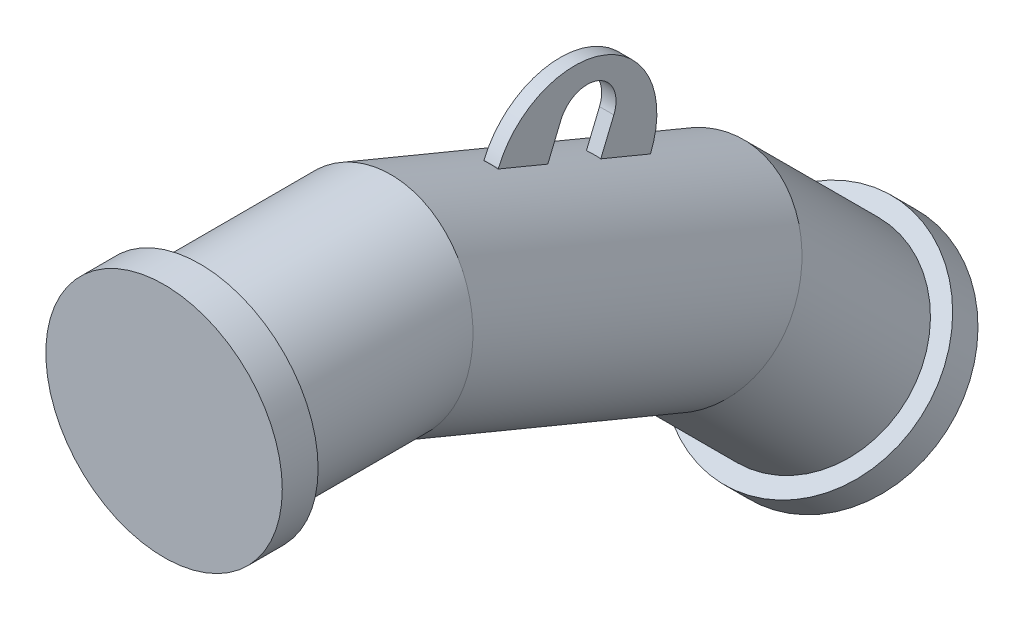
ISO-10303-21;
HEADER;
FILE_DESCRIPTION(('STEP AP214'),'2;1');
FILE_NAME('part.step','',(''),(''),'','','');
FILE_SCHEMA(('AUTOMOTIVE_DESIGN { 1 0 10303 214 1 1 1 1 }'));
ENDSEC;
DATA;
#1=APPLICATION_CONTEXT('core data for automotive mechanical design processes');
#2=APPLICATION_PROTOCOL_DEFINITION('international standard','automotive_design',2000,#1);
#3=PRODUCT_CONTEXT('',#1,'mechanical');
#4=PRODUCT('Part','Part','',(#3));
#5=PRODUCT_RELATED_PRODUCT_CATEGORY('part','',(#4));
#6=PRODUCT_DEFINITION_FORMATION('','',#4);
#7=PRODUCT_DEFINITION_CONTEXT('part definition',#1,'design');
#8=PRODUCT_DEFINITION('design','',#6,#7);
#9=PRODUCT_DEFINITION_SHAPE('','',#8);
#10=(LENGTH_UNIT() NAMED_UNIT(*) SI_UNIT(.MILLI.,.METRE.));
#11=(NAMED_UNIT(*) PLANE_ANGLE_UNIT() SI_UNIT($,.RADIAN.));
#12=(NAMED_UNIT(*) SI_UNIT($,.STERADIAN.) SOLID_ANGLE_UNIT());
#13=UNCERTAINTY_MEASURE_WITH_UNIT(LENGTH_MEASURE(1.E-05),#10,'distance_accuracy_value','');
#14=(GEOMETRIC_REPRESENTATION_CONTEXT(3) GLOBAL_UNCERTAINTY_ASSIGNED_CONTEXT((#13)) GLOBAL_UNIT_ASSIGNED_CONTEXT((#10,
#11,#12)) REPRESENTATION_CONTEXT('',''));
#15=CARTESIAN_POINT('',(0.,0.,0.));
#16=DIRECTION('',(0.,0.,1.));
#17=DIRECTION('',(1.,0.,0.));
#18=AXIS2_PLACEMENT_3D('',#15,#16,#17);
#19=CARTESIAN_POINT('',(0.,0.,0.));
#20=DIRECTION('',(0.,0.,0.999999999999916));
#21=DIRECTION('',(1.00000000000005,0.,0.));
#22=AXIS2_PLACEMENT_3D('',#19,#20,#21);
#23=PLANE('',#22);
#24=CARTESIAN_POINT('',(0.,0.,0.));
#25=DIRECTION('',(0.,0.,0.999999999999916));
#26=DIRECTION('',(1.00000000000005,0.,0.));
#27=AXIS2_PLACEMENT_3D('',#24,#25,#26);
#28=CIRCLE('',#27,82.5);
#29=CARTESIAN_POINT('',(82.5000000000045,-8.35834031172185E-13,-2.87214887425358E-13));
#30=VERTEX_POINT('',#29);
#31=EDGE_CURVE('E19',#30,#30,#28,.T.);
#32=ORIENTED_EDGE('',*,*,#31,.T.);
#33=EDGE_LOOP('',(#32));
#34=FACE_BOUND('',#33,.T.);
#35=ADVANCED_FACE('F15',(#34),#23,.T.);
#36=CARTESIAN_POINT('',(-4.26337247165444E-11,1.61815005839117E-11,-24.9999999999988));
#37=DIRECTION('',(0.,0.,0.999999999999916));
#38=DIRECTION('',(1.00000000000005,0.,0.));
#39=AXIS2_PLACEMENT_3D('',#36,#37,#38);
#40=CYLINDRICAL_SURFACE('',#39,82.5);
#41=CARTESIAN_POINT('',(-4.26337247165444E-11,1.61815005839117E-11,-24.9999999999988));
#42=DIRECTION('',(0.,0.,0.999999999999916));
#43=DIRECTION('',(1.00000000000005,0.,0.));
#44=AXIS2_PLACEMENT_3D('',#41,#42,#43);
#45=CIRCLE('',#44,82.5);
#46=CARTESIAN_POINT('',(82.4999999999618,1.53456665527395E-11,-24.9999999999991));
#47=VERTEX_POINT('',#46);
#48=EDGE_CURVE('E25',#47,#47,#45,.T.);
#49=ORIENTED_EDGE('',*,*,#48,.T.);
#50=EDGE_LOOP('',(#49));
#51=FACE_BOUND('',#50,.T.);
#52=ORIENTED_EDGE('',*,*,#31,.F.);
#53=EDGE_LOOP('',(#52));
#54=FACE_BOUND('',#53,.T.);
#55=ADVANCED_FACE('F17',(#51,#54),#40,.T.);
#56=CARTESIAN_POINT('',(-4.26337247165444E-11,1.61815005839117E-11,-24.9999999999988));
#57=DIRECTION('',(0.,0.,0.999999999999916));
#58=DIRECTION('',(1.00000000000005,0.,0.));
#59=AXIS2_PLACEMENT_3D('',#56,#57,#58);
#60=PLANE('',#59);
#61=CARTESIAN_POINT('',(2.82496841256107E-13,-3.70052382076315E-13,-24.9999999999986));
#62=DIRECTION('',(0.,0.,-0.999999999999921));
#63=DIRECTION('',(0.,0.999999999999963,0.));
#64=AXIS2_PLACEMENT_3D('',#61,#62,#63);
#65=CIRCLE('',#64,69.85);
#66=CARTESIAN_POINT('',(8.92674501720334E-13,69.849999999997,-24.9999999999982));
#67=VERTEX_POINT('',#66);
#68=EDGE_CURVE('E10',#67,#67,#65,.T.);
#69=ORIENTED_EDGE('',*,*,#68,.F.);
#70=EDGE_LOOP('',(#69));
#71=FACE_BOUND('',#70,.T.);
#72=ORIENTED_EDGE('',*,*,#48,.F.);
#73=EDGE_LOOP('',(#72));
#74=FACE_BOUND('',#73,.T.);
#75=ADVANCED_FACE('F197',(#71,#74),#60,.F.);
#76=CARTESIAN_POINT('',(-6.21841930394499E-12,-193.413600818346,-466.941738241031));
#77=DIRECTION('',(0.,-0.707106781186496,-0.707106781186481));
#78=DIRECTION('',(-1.00000000000005,0.,0.));
#79=AXIS2_PLACEMENT_3D('',#76,#77,#78);
#80=PLANE('',#79);
#81=CARTESIAN_POINT('',(-6.21841930394499E-12,-193.413600818346,-466.941738241031));
#82=DIRECTION('',(0.,-0.707106781186496,-0.707106781186481));
#83=DIRECTION('',(-1.00000000000005,0.,0.));
#84=AXIS2_PLACEMENT_3D('',#81,#82,#83);
#85=CIRCLE('',#84,82.5);
#86=CARTESIAN_POINT('',(-82.5000000000107,-193.413600818346,-466.94173824103));
#87=VERTEX_POINT('',#86);
#88=EDGE_CURVE('E179',#87,#87,#85,.T.);
#89=ORIENTED_EDGE('',*,*,#88,.T.);
#90=EDGE_LOOP('',(#89));
#91=FACE_BOUND('',#90,.T.);
#92=ADVANCED_FACE('F204',(#91),#80,.T.);
#93=CARTESIAN_POINT('',(3.64139176338186E-11,-175.735931288672,-449.26406871138));
#94=DIRECTION('',(0.,-0.707106781186496,-0.707106781186481));
#95=DIRECTION('',(-1.00000000000005,0.,0.));
#96=AXIS2_PLACEMENT_3D('',#93,#94,#95);
#97=CYLINDRICAL_SURFACE('',#96,82.5);
#98=CARTESIAN_POINT('',(3.64139176338186E-11,-175.735931288672,-449.26406871138));
#99=DIRECTION('',(0.,-0.707106781186496,-0.707106781186481));
#100=DIRECTION('',(-1.00000000000005,0.,0.));
#101=AXIS2_PLACEMENT_3D('',#98,#99,#100);
#102=CIRCLE('',#101,82.5);
#103=CARTESIAN_POINT('',(-82.4999999999681,-175.735931288672,-449.264068711379));
#104=VERTEX_POINT('',#103);
#105=EDGE_CURVE('E153',#104,#104,#102,.T.);
#106=ORIENTED_EDGE('',*,*,#105,.T.);
#107=EDGE_LOOP('',(#106));
#108=FACE_BOUND('',#107,.T.);
#109=ORIENTED_EDGE('',*,*,#88,.F.);
#110=EDGE_LOOP('',(#109));
#111=FACE_BOUND('',#110,.T.);
#112=ADVANCED_FACE('F214',(#108,#111),#97,.T.);
#113=CARTESIAN_POINT('',(3.64139176338186E-11,-175.735931288672,-449.26406871138));
#114=DIRECTION('',(0.,-0.707106781186496,-0.707106781186481));
#115=DIRECTION('',(-1.00000000000005,0.,0.));
#116=AXIS2_PLACEMENT_3D('',#113,#114,#115);
#117=PLANE('',#116);
#118=CARTESIAN_POINT('',(-1.21882993579131E-12,-175.735931288683,-449.264068711368));
#119=DIRECTION('',(0.,0.707106781186488,0.707106781186495));
#120=DIRECTION('',(0.,0.707106781186517,-0.707106781186525));
#121=AXIS2_PLACEMENT_3D('',#118,#119,#120);
#122=CIRCLE('',#121,69.85);
#123=CARTESIAN_POINT('',(-1.8105896901664E-12,-126.344522622805,-498.655477377247));
#124=VERTEX_POINT('',#123);
#125=EDGE_CURVE('E149',#124,#124,#122,.T.);
#126=ORIENTED_EDGE('',*,*,#125,.F.);
#127=EDGE_LOOP('',(#126));
#128=FACE_BOUND('',#127,.T.);
#129=ORIENTED_EDGE('',*,*,#105,.F.);
#130=EDGE_LOOP('',(#129));
#131=FACE_BOUND('',#130,.T.);
#132=ADVANCED_FACE('F217',(#128,#131),#117,.F.);
#133=CARTESIAN_POINT('',(6.94759500474921E-12,-91.3445609864393,-364.872698410294));
#134=DIRECTION('',(0.,0.382683432365097,0.923879532511179));
#135=DIRECTION('',(0.,-0.923879532511241,0.382683432365016));
#136=AXIS2_PLACEMENT_3D('',#133,#134,#135);
#137=CYLINDRICAL_SURFACE('',#136,69.85);
#138=CARTESIAN_POINT('',(4.16212892876642E-12,-38.0186118458926,-236.132468768786));
#139=DIRECTION('',(0.,0.382683432365091,0.923879532511287));
#140=DIRECTION('',(0.,-0.923879532511287,0.382683432365091));
#141=AXIS2_PLACEMENT_3D('',#138,#139,#140);
#142=CIRCLE('',#141,69.85);
#143=CARTESIAN_POINT('',(4.99999999999889,26.3488283928618,-262.794335490932));
#144=VERTEX_POINT('',#143);
#145=CARTESIAN_POINT('',(-5.00000000000111,26.348828392861,-262.794335490932));
#146=VERTEX_POINT('',#145);
#147=EDGE_CURVE('E172',#144,#146,#142,.T.);
#148=ORIENTED_EDGE('',*,*,#147,.F.);
#149=DIRECTION('',(0.,0.382683432365097,0.923879532511179));
#150=VECTOR('',#149,1.);
#151=CARTESIAN_POINT('',(5.00000000000028,-26.9771207476809,-391.534565132431));
#152=LINE('',#151,#150);
#153=CARTESIAN_POINT('',(5.00000000000028,40.6994571065655,-228.14885302175));
#154=VERTEX_POINT('',#153);
#155=EDGE_CURVE('E168',#144,#154,#152,.T.);
#156=ORIENTED_EDGE('',*,*,#155,.T.);
#157=CARTESIAN_POINT('',(3.41252784157975E-12,-23.6679831322002,-201.486986299613));
#158=DIRECTION('',(0.,-0.38268343236509,-0.923879532511287));
#159=DIRECTION('',(0.,0.923879532511287,-0.38268343236509));
#160=AXIS2_PLACEMENT_3D('',#157,#158,#159);
#161=CIRCLE('',#160,69.85);
#162=CARTESIAN_POINT('',(-4.99999999999972,40.699457106565,-228.14885302175));
#163=VERTEX_POINT('',#162);
#164=EDGE_CURVE('E161',#163,#154,#161,.T.);
#165=ORIENTED_EDGE('',*,*,#164,.F.);
#166=DIRECTION('',(0.,0.382683432365097,0.923879532511179));
#167=VECTOR('',#166,1.);
#168=CARTESIAN_POINT('',(-4.99999999999972,-26.9771207476818,-391.534565132431));
#169=LINE('',#168,#167);
#170=EDGE_CURVE('E165',#146,#163,#169,.T.);
#171=ORIENTED_EDGE('',*,*,#170,.F.);
#172=EDGE_LOOP('',(#148,#156,#165,#171));
#173=FACE_BOUND('',#172,.T.);
#174=CARTESIAN_POINT('',(6.94759500474921E-12,-91.3445609864393,-364.872698410294));
#175=DIRECTION('',(0.,-0.555570233019579,-0.831469612302443));
#176=DIRECTION('',(0.,-0.831469612302498,0.5555702330195));
#177=AXIS2_PLACEMENT_3D('',#174,#175,#176);
#178=ELLIPSE('',#177,71.218442400851,69.85);
#179=CARTESIAN_POINT('',(6.16989241807986E-12,-150.560531678263,-325.305851770368));
#180=VERTEX_POINT('',#179);
#181=EDGE_CURVE('E148',#180,#180,#178,.T.);
#182=ORIENTED_EDGE('',*,*,#181,.F.);
#183=EDGE_LOOP('',(#182));
#184=FACE_BOUND('',#183,.T.);
#185=CARTESIAN_POINT('',(-8.45514581214761E-11,6.04979249429979E-11,-144.347420427707));
#186=DIRECTION('',(0.,-0.195090322016126,-0.980785280403153));
#187=DIRECTION('',(0.,-0.98078528040319,0.195090322016101));
#188=AXIS2_PLACEMENT_3D('',#185,#186,#187);
#189=ELLIPSE('',#188,71.218442400851,69.85);
#190=CARTESIAN_POINT('',(-8.53661484978693E-11,-69.8499999999366,-130.45339156624));
#191=VERTEX_POINT('',#190);
#192=EDGE_CURVE('E156',#191,#191,#189,.T.);
#193=ORIENTED_EDGE('',*,*,#192,.T.);
#194=EDGE_LOOP('',(#193));
#195=FACE_BOUND('',#194,.T.);
#196=CARTESIAN_POINT('',(4.96170342176555E-12,-53.3259491404982,-273.087650069237));
#197=DIRECTION('',(0.,-0.38268343236509,-0.923879532511287));
#198=DIRECTION('',(0.,0.923879532511287,-0.38268343236509));
#199=AXIS2_PLACEMENT_3D('',#196,#197,#198);
#200=CIRCLE('',#199,69.85);
#201=CARTESIAN_POINT('',(-5.00000000000071,11.0414910982569,-299.749516791379));
#202=VERTEX_POINT('',#201);
#203=CARTESIAN_POINT('',(4.99999999999929,11.0414910982578,-299.74951679138));
#204=VERTEX_POINT('',#203);
#205=EDGE_CURVE('E46',#202,#204,#200,.T.);
#206=ORIENTED_EDGE('',*,*,#205,.F.);
#207=CARTESIAN_POINT('',(-4.99999999999972,-3.30913761542546,-334.394999260545));
#208=VERTEX_POINT('',#207);
#209=EDGE_CURVE('E169',#208,#202,#169,.T.);
#210=ORIENTED_EDGE('',*,*,#209,.F.);
#211=CARTESIAN_POINT('',(5.71130450895221E-12,-67.6765778541905,-307.733132538409));
#212=DIRECTION('',(0.,0.38268343236509,0.923879532511287));
#213=DIRECTION('',(0.,-0.923879532511287,0.38268343236509));
#214=AXIS2_PLACEMENT_3D('',#211,#212,#213);
#215=CIRCLE('',#214,69.85);
#216=CARTESIAN_POINT('',(5.00000000000029,-3.30913761542477,-334.394999260546));
#217=VERTEX_POINT('',#216);
#218=EDGE_CURVE('E108',#217,#208,#215,.T.);
#219=ORIENTED_EDGE('',*,*,#218,.F.);
#220=EDGE_CURVE('E38',#217,#204,#152,.T.);
#221=ORIENTED_EDGE('',*,*,#220,.T.);
#222=EDGE_LOOP('',(#206,#210,#219,#221));
#223=FACE_BOUND('',#222,.T.);
#224=ADVANCED_FACE('F223',(#173,#184,#195,#223),#137,.T.);
#225=CARTESIAN_POINT('',(-8.45514581214761E-11,6.04979249429979E-11,-144.347420427707));
#226=DIRECTION('',(0.,0.,0.999999999999921));
#227=DIRECTION('',(0.,-0.999999999999963,0.));
#228=AXIS2_PLACEMENT_3D('',#225,#226,#227);
#229=CYLINDRICAL_SURFACE('',#228,69.85);
#230=ORIENTED_EDGE('',*,*,#68,.T.);
#231=EDGE_LOOP('',(#230));
#232=FACE_BOUND('',#231,.T.);
#233=ORIENTED_EDGE('',*,*,#192,.F.);
#234=EDGE_LOOP('',(#233));
#235=FACE_BOUND('',#234,.T.);
#236=ADVANCED_FACE('F225',(#232,#235),#229,.T.);
#237=CARTESIAN_POINT('',(8.36068436360604E-11,-91.3445609870859,-364.872698409857));
#238=DIRECTION('',(0.,-0.707106781186488,-0.707106781186495));
#239=DIRECTION('',(0.,-0.707106781186517,0.707106781186525));
#240=AXIS2_PLACEMENT_3D('',#237,#238,#239);
#241=CYLINDRICAL_SURFACE('',#240,69.85);
#242=ORIENTED_EDGE('',*,*,#125,.T.);
#243=EDGE_LOOP('',(#242));
#244=FACE_BOUND('',#243,.T.);
#245=ORIENTED_EDGE('',*,*,#181,.T.);
#246=EDGE_LOOP('',(#245));
#247=FACE_BOUND('',#246,.T.);
#248=ADVANCED_FACE('F228',(#244,#247),#241,.T.);
#249=CARTESIAN_POINT('',(5.00000000000028,40.7104557966009,-290.390960345143));
#250=DIRECTION('',(1.,0.,0.));
#251=DIRECTION('',(0.,0.923879532511287,-0.382683432365091));
#252=AXIS2_PLACEMENT_3D('',#249,#250,#251);
#253=PLANE('',#252);
#254=ORIENTED_EDGE('',*,*,#220,.F.);
#255=DIRECTION('',(0.,0.923879532511287,-0.38268343236509));
#256=VECTOR('',#255,1.);
#257=CARTESIAN_POINT('',(5.00000000000028,-12.24380590352,-330.694138480312));
#258=LINE('',#257,#256);
#259=CARTESIAN_POINT('',(5.00000000000028,-3.00501057840708,-334.520972803963));
#260=VERTEX_POINT('',#259);
#261=EDGE_CURVE('E112',#217,#260,#258,.T.);
#262=ORIENTED_EDGE('',*,*,#261,.T.);
#263=CARTESIAN_POINT('',(5.00000000000028,18.9992867825856,-281.397899684564));
#264=DIRECTION('',(1.,0.,0.));
#265=DIRECTION('',(0.,0.923879532511287,-0.382683432365091));
#266=AXIS2_PLACEMENT_3D('',#263,#264,#265);
#267=CIRCLE('',#266,57.5);
#268=CARTESIAN_POINT('',(5.00000000000028,41.0035841435782,-228.274826565165));
#269=VERTEX_POINT('',#268);
#270=EDGE_CURVE('E130',#260,#269,#267,.T.);
#271=ORIENTED_EDGE('',*,*,#270,.T.);
#272=DIRECTION('',(0.,0.923879532511287,-0.38268343236509));
#273=VECTOR('',#272,1.);
#274=CARTESIAN_POINT('',(5.00000000000028,31.7647888184654,-224.447992241514));
#275=LINE('',#274,#273);
#276=EDGE_CURVE('E263',#154,#269,#275,.T.);
#277=ORIENTED_EDGE('',*,*,#276,.F.);
#278=ORIENTED_EDGE('',*,*,#155,.F.);
#279=DIRECTION('',(0.,0.923879532511287,-0.382683432365091));
#280=VECTOR('',#279,1.);
#281=CARTESIAN_POINT('',(5.00000000000028,26.6529554298874,-262.920309034338));
#282=LINE('',#281,#280);
#283=CARTESIAN_POINT('',(5.00000000000028,48.3641244439028,-271.913369694918));
#284=VERTEX_POINT('',#283);
#285=EDGE_CURVE('E124',#144,#284,#282,.T.);
#286=ORIENTED_EDGE('',*,*,#285,.T.);
#287=CARTESIAN_POINT('',(5.00000000000028,40.7104557966009,-290.390960345143));
#288=DIRECTION('',(-1.,0.,0.));
#289=DIRECTION('',(0.,0.923879532511287,-0.382683432365091));
#290=AXIS2_PLACEMENT_3D('',#287,#288,#289);
#291=CIRCLE('',#290,20.);
#292=CARTESIAN_POINT('',(5.00000000000028,33.0567871492991,-308.868550995369));
#293=VERTEX_POINT('',#292);
#294=EDGE_CURVE('E273',#284,#293,#291,.T.);
#295=ORIENTED_EDGE('',*,*,#294,.T.);
#296=DIRECTION('',(0.,-0.923879532511287,0.38268343236509));
#297=VECTOR('',#296,1.);
#298=CARTESIAN_POINT('',(5.00000000000028,11.3456181352838,-299.87549033479));
#299=LINE('',#298,#297);
#300=EDGE_CURVE('E276',#293,#204,#299,.T.);
#301=ORIENTED_EDGE('',*,*,#300,.T.);
#302=EDGE_LOOP('',(#254,#262,#271,#277,#278,#286,#295,#301));
#303=FACE_BOUND('',#302,.T.);
#304=ADVANCED_FACE('F235',(#303),#253,.T.);
#305=CARTESIAN_POINT('',(-4.99999999999972,40.7104557966009,-290.390960345143));
#306=DIRECTION('',(1.,0.,0.));
#307=DIRECTION('',(0.,0.923879532511287,-0.382683432365091));
#308=AXIS2_PLACEMENT_3D('',#305,#306,#307);
#309=PLANE('',#308);
#310=DIRECTION('',(0.,0.923879532511287,-0.38268343236509));
#311=VECTOR('',#310,1.);
#312=CARTESIAN_POINT('',(-4.99999999999972,-12.24380590352,-330.694138480312));
#313=LINE('',#312,#311);
#314=CARTESIAN_POINT('',(-4.99999999999972,-3.00501057840716,-334.520972803963));
#315=VERTEX_POINT('',#314);
#316=EDGE_CURVE('E102',#208,#315,#313,.T.);
#317=ORIENTED_EDGE('',*,*,#316,.F.);
#318=ORIENTED_EDGE('',*,*,#209,.T.);
#319=DIRECTION('',(0.,-0.923879532511287,0.38268343236509));
#320=VECTOR('',#319,1.);
#321=CARTESIAN_POINT('',(-4.99999999999972,11.3456181352838,-299.87549033479));
#322=LINE('',#321,#320);
#323=CARTESIAN_POINT('',(-4.99999999999972,33.0567871492991,-308.868550995369));
#324=VERTEX_POINT('',#323);
#325=EDGE_CURVE('E125',#324,#202,#322,.T.);
#326=ORIENTED_EDGE('',*,*,#325,.F.);
#327=CARTESIAN_POINT('',(-4.99999999999972,40.7104557966009,-290.390960345143));
#328=DIRECTION('',(-1.,0.,0.));
#329=DIRECTION('',(0.,0.923879532511287,-0.382683432365091));
#330=AXIS2_PLACEMENT_3D('',#327,#328,#329);
#331=CIRCLE('',#330,20.);
#332=CARTESIAN_POINT('',(-4.99999999999972,48.3641244439028,-271.913369694918));
#333=VERTEX_POINT('',#332);
#334=EDGE_CURVE('E284',#333,#324,#331,.T.);
#335=ORIENTED_EDGE('',*,*,#334,.F.);
#336=DIRECTION('',(0.,0.923879532511287,-0.382683432365091));
#337=VECTOR('',#336,1.);
#338=CARTESIAN_POINT('',(-4.99999999999972,26.6529554298874,-262.920309034338));
#339=LINE('',#338,#337);
#340=EDGE_CURVE('E111',#146,#333,#339,.T.);
#341=ORIENTED_EDGE('',*,*,#340,.F.);
#342=ORIENTED_EDGE('',*,*,#170,.T.);
#343=DIRECTION('',(0.,0.923879532511287,-0.38268343236509));
#344=VECTOR('',#343,1.);
#345=CARTESIAN_POINT('',(-4.99999999999972,31.7647888184654,-224.447992241514));
#346=LINE('',#345,#344);
#347=CARTESIAN_POINT('',(-4.99999999999972,41.0035841435782,-228.274826565165));
#348=VERTEX_POINT('',#347);
#349=EDGE_CURVE('E119',#163,#348,#346,.T.);
#350=ORIENTED_EDGE('',*,*,#349,.T.);
#351=CARTESIAN_POINT('',(-4.99999999999972,18.9992867825857,-281.397899684564));
#352=DIRECTION('',(1.,0.,0.));
#353=DIRECTION('',(0.,0.923879532511287,-0.382683432365091));
#354=AXIS2_PLACEMENT_3D('',#351,#352,#353);
#355=CIRCLE('',#354,57.5);
#356=EDGE_CURVE('E115',#315,#348,#355,.T.);
#357=ORIENTED_EDGE('',*,*,#356,.F.);
#358=EDGE_LOOP('',(#317,#318,#326,#335,#341,#342,#350,#357));
#359=FACE_BOUND('',#358,.T.);
#360=ADVANCED_FACE('F116',(#359),#309,.F.);
#361=CARTESIAN_POINT('',(5.00000000000028,26.6529554298874,-262.920309034338));
#362=DIRECTION('',(0.,0.382683432365091,0.923879532511287));
#363=DIRECTION('',(0.,-0.923879532511287,0.382683432365091));
#364=AXIS2_PLACEMENT_3D('',#361,#362,#363);
#365=PLANE('',#364);
#366=ORIENTED_EDGE('',*,*,#285,.F.);
#367=ORIENTED_EDGE('',*,*,#147,.T.);
#368=ORIENTED_EDGE('',*,*,#340,.T.);
#369=DIRECTION('',(-1.,0.,0.));
#370=VECTOR('',#369,1.);
#371=CARTESIAN_POINT('',(5.00000000000028,48.3641244439028,-271.913369694918));
#372=LINE('',#371,#370);
#373=EDGE_CURVE('E140',#284,#333,#372,.T.);
#374=ORIENTED_EDGE('',*,*,#373,.F.);
#375=EDGE_LOOP('',(#366,#367,#368,#374));
#376=FACE_BOUND('',#375,.T.);
#377=ADVANCED_FACE('F237',(#376),#365,.F.);
#378=CARTESIAN_POINT('',(5.00000000000028,40.7104557966009,-290.390960345143));
#379=DIRECTION('',(-1.,0.,0.));
#380=DIRECTION('',(0.,-0.923879532511287,0.382683432365091));
#381=AXIS2_PLACEMENT_3D('',#378,#379,#380);
#382=CYLINDRICAL_SURFACE('',#381,20.);
#383=ORIENTED_EDGE('',*,*,#334,.T.);
#384=DIRECTION('',(-1.,0.,0.));
#385=VECTOR('',#384,1.);
#386=CARTESIAN_POINT('',(5.00000000000028,33.0567871492991,-308.868550995369));
#387=LINE('',#386,#385);
#388=EDGE_CURVE('E132',#293,#324,#387,.T.);
#389=ORIENTED_EDGE('',*,*,#388,.F.);
#390=ORIENTED_EDGE('',*,*,#294,.F.);
#391=ORIENTED_EDGE('',*,*,#373,.T.);
#392=EDGE_LOOP('',(#383,#389,#390,#391));
#393=FACE_BOUND('',#392,.T.);
#394=ADVANCED_FACE('F239',(#393),#382,.F.);
#395=CARTESIAN_POINT('',(5.00000000000028,11.3456181352838,-299.87549033479));
#396=DIRECTION('',(0.,-0.38268343236509,-0.923879532511287));
#397=DIRECTION('',(0.,0.923879532511287,-0.38268343236509));
#398=AXIS2_PLACEMENT_3D('',#395,#396,#397);
#399=PLANE('',#398);
#400=ORIENTED_EDGE('',*,*,#325,.T.);
#401=ORIENTED_EDGE('',*,*,#205,.T.);
#402=ORIENTED_EDGE('',*,*,#300,.F.);
#403=ORIENTED_EDGE('',*,*,#388,.T.);
#404=EDGE_LOOP('',(#400,#401,#402,#403));
#405=FACE_BOUND('',#404,.T.);
#406=ADVANCED_FACE('F243',(#405),#399,.F.);
#407=CARTESIAN_POINT('',(5.00000000000028,18.9992867825856,-281.397899684564));
#408=DIRECTION('',(-1.,0.,0.));
#409=DIRECTION('',(0.,-0.923879532511287,0.382683432365091));
#410=AXIS2_PLACEMENT_3D('',#407,#408,#409);
#411=CYLINDRICAL_SURFACE('',#410,57.5);
#412=ORIENTED_EDGE('',*,*,#356,.T.);
#413=DIRECTION('',(-1.,0.,0.));
#414=VECTOR('',#413,1.);
#415=CARTESIAN_POINT('',(5.00000000000028,41.0035841435782,-228.274826565165));
#416=LINE('',#415,#414);
#417=EDGE_CURVE('E133',#269,#348,#416,.T.);
#418=ORIENTED_EDGE('',*,*,#417,.F.);
#419=ORIENTED_EDGE('',*,*,#270,.F.);
#420=DIRECTION('',(-1.,0.,0.));
#421=VECTOR('',#420,1.);
#422=CARTESIAN_POINT('',(5.00000000000028,-3.00501057840708,-334.520972803963));
#423=LINE('',#422,#421);
#424=EDGE_CURVE('E107',#260,#315,#423,.T.);
#425=ORIENTED_EDGE('',*,*,#424,.T.);
#426=EDGE_LOOP('',(#412,#418,#419,#425));
#427=FACE_BOUND('',#426,.T.);
#428=ADVANCED_FACE('F128',(#427),#411,.T.);
#429=CARTESIAN_POINT('',(-4.99999999999972,-12.24380590352,-330.694138480312));
#430=DIRECTION('',(0.,0.38268343236509,0.923879532511287));
#431=DIRECTION('',(0.,-0.923879532511287,0.38268343236509));
#432=AXIS2_PLACEMENT_3D('',#429,#430,#431);
#433=PLANE('',#432);
#434=ORIENTED_EDGE('',*,*,#261,.F.);
#435=ORIENTED_EDGE('',*,*,#218,.T.);
#436=ORIENTED_EDGE('',*,*,#316,.T.);
#437=ORIENTED_EDGE('',*,*,#424,.F.);
#438=EDGE_LOOP('',(#434,#435,#436,#437));
#439=FACE_BOUND('',#438,.T.);
#440=ADVANCED_FACE('F105',(#439),#433,.F.);
#441=CARTESIAN_POINT('',(5.00000000000028,31.7647888184654,-224.447992241514));
#442=DIRECTION('',(0.,-0.38268343236509,-0.923879532511287));
#443=DIRECTION('',(0.,0.923879532511287,-0.38268343236509));
#444=AXIS2_PLACEMENT_3D('',#441,#442,#443);
#445=PLANE('',#444);
#446=ORIENTED_EDGE('',*,*,#349,.F.);
#447=ORIENTED_EDGE('',*,*,#164,.T.);
#448=ORIENTED_EDGE('',*,*,#276,.T.);
#449=ORIENTED_EDGE('',*,*,#417,.T.);
#450=EDGE_LOOP('',(#446,#447,#448,#449));
#451=FACE_BOUND('',#450,.T.);
#452=ADVANCED_FACE('F256',(#451),#445,.F.);
#453=CLOSED_SHELL('',(#35,#55,#75,#92,#112,#132,#224,#236,#248,#304,#360,#377,#394,#406,#428,
#440,#452));
#454=MANIFOLD_SOLID_BREP('B1',#453);
#455=ADVANCED_BREP_SHAPE_REPRESENTATION('',(#18,#454),#14);
#456=SHAPE_DEFINITION_REPRESENTATION(#9,#455);
ENDSEC;
END-ISO-10303-21;
